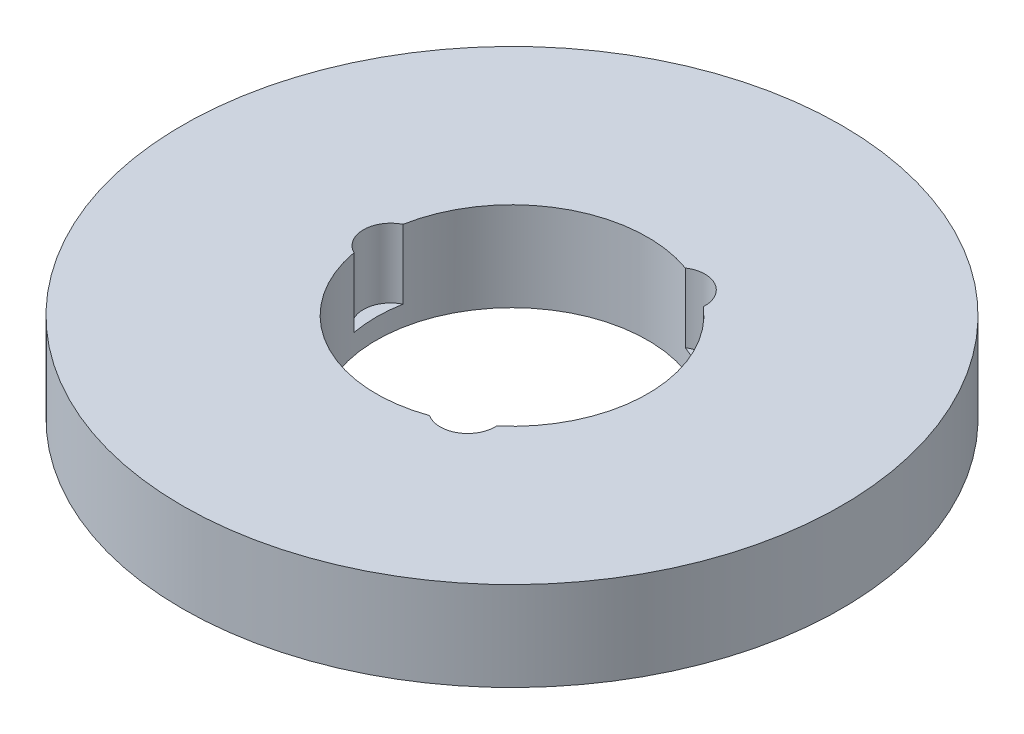
ISO-10303-21;
HEADER;
FILE_DESCRIPTION(('STEP AP214'),'2;1');
FILE_NAME('part.step','',(''),(''),'','','');
FILE_SCHEMA(('AUTOMOTIVE_DESIGN { 1 0 10303 214 1 1 1 1 }'));
ENDSEC;
DATA;
#1=APPLICATION_CONTEXT('core data for automotive mechanical design processes');
#2=APPLICATION_PROTOCOL_DEFINITION('international standard','automotive_design',2000,#1);
#3=PRODUCT_CONTEXT('',#1,'mechanical');
#4=PRODUCT('Part','Part','',(#3));
#5=PRODUCT_RELATED_PRODUCT_CATEGORY('part','',(#4));
#6=PRODUCT_DEFINITION_FORMATION('','',#4);
#7=PRODUCT_DEFINITION_CONTEXT('part definition',#1,'design');
#8=PRODUCT_DEFINITION('design','',#6,#7);
#9=PRODUCT_DEFINITION_SHAPE('','',#8);
#10=(LENGTH_UNIT() NAMED_UNIT(*) SI_UNIT(.MILLI.,.METRE.));
#11=(NAMED_UNIT(*) PLANE_ANGLE_UNIT() SI_UNIT($,.RADIAN.));
#12=(NAMED_UNIT(*) SI_UNIT($,.STERADIAN.) SOLID_ANGLE_UNIT());
#13=UNCERTAINTY_MEASURE_WITH_UNIT(LENGTH_MEASURE(1.E-05),#10,'distance_accuracy_value','');
#14=(GEOMETRIC_REPRESENTATION_CONTEXT(3) GLOBAL_UNCERTAINTY_ASSIGNED_CONTEXT((#13)) GLOBAL_UNIT_ASSIGNED_CONTEXT((#10,
#11,#12)) REPRESENTATION_CONTEXT('',''));
#15=CARTESIAN_POINT('',(0.,0.,0.));
#16=DIRECTION('',(0.,0.,1.));
#17=DIRECTION('',(1.,0.,0.));
#18=AXIS2_PLACEMENT_3D('',#15,#16,#17);
#19=CARTESIAN_POINT('',(0.,23.,0.));
#20=DIRECTION('',(0.,-1.,0.));
#21=DIRECTION('',(0.,0.,-1.));
#22=AXIS2_PLACEMENT_3D('',#19,#20,#21);
#23=CYLINDRICAL_SURFACE('',#22,85.);
#24=CARTESIAN_POINT('',(0.,23.,0.));
#25=DIRECTION('',(0.,1.,0.));
#26=DIRECTION('',(0.,0.,1.));
#27=AXIS2_PLACEMENT_3D('',#24,#25,#26);
#28=CIRCLE('',#27,85.);
#29=CARTESIAN_POINT('',(0.,23.,85.));
#30=VERTEX_POINT('',#29);
#31=EDGE_CURVE('E130',#30,#30,#28,.T.);
#32=ORIENTED_EDGE('',*,*,#31,.F.);
#33=EDGE_LOOP('',(#32));
#34=FACE_BOUND('',#33,.T.);
#35=CARTESIAN_POINT('',(0.,0.,0.));
#36=DIRECTION('',(0.,1.,0.));
#37=DIRECTION('',(0.,0.,1.));
#38=AXIS2_PLACEMENT_3D('',#35,#36,#37);
#39=CIRCLE('',#38,85.);
#40=CARTESIAN_POINT('',(0.,0.,85.));
#41=VERTEX_POINT('',#40);
#42=EDGE_CURVE('E117',#41,#41,#39,.T.);
#43=ORIENTED_EDGE('',*,*,#42,.T.);
#44=EDGE_LOOP('',(#43));
#45=FACE_BOUND('',#44,.T.);
#46=ADVANCED_FACE('F39',(#34,#45),#23,.T.);
#47=CARTESIAN_POINT('',(0.,23.,0.));
#48=DIRECTION('',(0.,1.,0.));
#49=DIRECTION('',(0.,0.,1.));
#50=AXIS2_PLACEMENT_3D('',#47,#48,#49);
#51=PLANE('',#50);
#52=CARTESIAN_POINT('',(15.6275728823636,23.,27.0677502312391));
#53=DIRECTION('',(0.,1.,0.));
#54=DIRECTION('',(0.866025403784436,0.,-0.500000000000004));
#55=AXIS2_PLACEMENT_3D('',#52,#53,#54);
#56=CIRCLE('',#55,7.07740934402539);
#57=CARTESIAN_POINT('',(11.730589182881,23.,32.9756467324369));
#58=VERTEX_POINT('',#57);
#59=CARTESIAN_POINT('',(22.6924531850714,23.,26.6468115999522));
#60=VERTEX_POINT('',#59);
#61=EDGE_CURVE('E148',#58,#60,#56,.T.);
#62=ORIENTED_EDGE('',*,*,#61,.F.);
#63=CARTESIAN_POINT('',(0.,23.,0.));
#64=DIRECTION('',(0.,1.,0.));
#65=DIRECTION('',(0.,0.,1.));
#66=AXIS2_PLACEMENT_3D('',#63,#64,#65);
#67=CIRCLE('',#66,35.);
#68=CARTESIAN_POINT('',(-34.4230423679521,23.,6.32883513248467));
#69=VERTEX_POINT('',#68);
#70=EDGE_CURVE('E113',#69,#58,#67,.T.);
#71=ORIENTED_EDGE('',*,*,#70,.F.);
#72=CARTESIAN_POINT('',(-31.255145764727,23.,0.));
#73=DIRECTION('',(0.,1.,0.));
#74=DIRECTION('',(0.,0.,1.));
#75=AXIS2_PLACEMENT_3D('',#72,#73,#74);
#76=CIRCLE('',#75,7.07740934402539);
#77=CARTESIAN_POINT('',(-34.4230423679521,23.,-6.32883513248467));
#78=VERTEX_POINT('',#77);
#79=EDGE_CURVE('E125',#78,#69,#76,.T.);
#80=ORIENTED_EDGE('',*,*,#79,.F.);
#81=CARTESIAN_POINT('',(11.7305891828806,23.,-32.975646732437));
#82=VERTEX_POINT('',#81);
#83=EDGE_CURVE('E107',#82,#78,#67,.T.);
#84=ORIENTED_EDGE('',*,*,#83,.F.);
#85=CARTESIAN_POINT('',(15.6275728823632,23.,-27.0677502312393));
#86=DIRECTION('',(0.,1.,0.));
#87=DIRECTION('',(-0.866025403784443,0.,-0.499999999999992));
#88=AXIS2_PLACEMENT_3D('',#85,#86,#87);
#89=CIRCLE('',#88,7.07740934402539);
#90=CARTESIAN_POINT('',(22.692453185071,23.,-26.6468115999525));
#91=VERTEX_POINT('',#90);
#92=EDGE_CURVE('E95',#91,#82,#89,.T.);
#93=ORIENTED_EDGE('',*,*,#92,.F.);
#94=EDGE_CURVE('E106',#60,#91,#67,.T.);
#95=ORIENTED_EDGE('',*,*,#94,.F.);
#96=EDGE_LOOP('',(#62,#71,#80,#84,#93,#95));
#97=FACE_BOUND('',#96,.T.);
#98=ORIENTED_EDGE('',*,*,#31,.T.);
#99=EDGE_LOOP('',(#98));
#100=FACE_BOUND('',#99,.T.);
#101=ADVANCED_FACE('F102',(#97,#100),#51,.T.);
#102=CARTESIAN_POINT('',(0.,0.,0.));
#103=DIRECTION('',(0.,1.,0.));
#104=DIRECTION('',(0.,0.,1.));
#105=AXIS2_PLACEMENT_3D('',#102,#103,#104);
#106=PLANE('',#105);
#107=CARTESIAN_POINT('',(0.,0.,0.));
#108=DIRECTION('',(0.,1.,0.));
#109=DIRECTION('',(0.,0.,1.));
#110=AXIS2_PLACEMENT_3D('',#107,#108,#109);
#111=CIRCLE('',#110,35.);
#112=CARTESIAN_POINT('',(0.,0.,35.));
#113=VERTEX_POINT('',#112);
#114=EDGE_CURVE('E118',#113,#113,#111,.T.);
#115=ORIENTED_EDGE('',*,*,#114,.T.);
#116=EDGE_LOOP('',(#115));
#117=FACE_BOUND('',#116,.T.);
#118=ORIENTED_EDGE('',*,*,#42,.F.);
#119=EDGE_LOOP('',(#118));
#120=FACE_BOUND('',#119,.T.);
#121=ADVANCED_FACE('F161',(#117,#120),#106,.F.);
#122=CARTESIAN_POINT('',(0.,23.,0.));
#123=DIRECTION('',(0.,-1.,0.));
#124=DIRECTION('',(0.,0.,-1.));
#125=AXIS2_PLACEMENT_3D('',#122,#123,#124);
#126=CYLINDRICAL_SURFACE('',#125,35.);
#127=DIRECTION('',(0.,1.,0.));
#128=VECTOR('',#127,1.);
#129=CARTESIAN_POINT('',(11.730589182881,14.0856113058301,32.9756467324369));
#130=LINE('',#129,#128);
#131=CARTESIAN_POINT('',(11.730589182881,5.1712226116602,32.9756467324369));
#132=VERTEX_POINT('',#131);
#133=EDGE_CURVE('E11',#132,#58,#130,.T.);
#134=ORIENTED_EDGE('',*,*,#133,.F.);
#135=CARTESIAN_POINT('',(0.,5.1712226116602,0.));
#136=DIRECTION('',(0.,1.,0.));
#137=DIRECTION('',(0.,0.,1.));
#138=AXIS2_PLACEMENT_3D('',#135,#136,#137);
#139=CIRCLE('',#138,35.);
#140=CARTESIAN_POINT('',(22.6924531850714,5.1712226116602,26.6468115999522));
#141=VERTEX_POINT('',#140);
#142=EDGE_CURVE('E100',#132,#141,#139,.T.);
#143=ORIENTED_EDGE('',*,*,#142,.T.);
#144=DIRECTION('',(0.,1.,0.));
#145=VECTOR('',#144,1.);
#146=CARTESIAN_POINT('',(22.6924531850714,14.0856113058301,26.6468115999522));
#147=LINE('',#146,#145);
#148=EDGE_CURVE('E46',#60,#141,#147,.F.);
#149=ORIENTED_EDGE('',*,*,#148,.F.);
#150=ORIENTED_EDGE('',*,*,#94,.T.);
#151=DIRECTION('',(0.,1.,0.));
#152=VECTOR('',#151,1.);
#153=CARTESIAN_POINT('',(22.692453185071,14.0856113058301,-26.6468115999525));
#154=LINE('',#153,#152);
#155=CARTESIAN_POINT('',(22.692453185071,5.1712226116602,-26.6468115999525));
#156=VERTEX_POINT('',#155);
#157=EDGE_CURVE('E90',#156,#91,#154,.T.);
#158=ORIENTED_EDGE('',*,*,#157,.F.);
#159=CARTESIAN_POINT('',(0.,5.1712226116602,0.));
#160=DIRECTION('',(0.,1.,0.));
#161=DIRECTION('',(0.,0.,1.));
#162=AXIS2_PLACEMENT_3D('',#159,#160,#161);
#163=CIRCLE('',#162,35.);
#164=CARTESIAN_POINT('',(11.7305891828806,5.1712226116602,-32.975646732437));
#165=VERTEX_POINT('',#164);
#166=EDGE_CURVE('E143',#156,#165,#163,.T.);
#167=ORIENTED_EDGE('',*,*,#166,.T.);
#168=DIRECTION('',(0.,1.,0.));
#169=VECTOR('',#168,1.);
#170=CARTESIAN_POINT('',(11.7305891828806,14.0856113058301,-32.9756467324371));
#171=LINE('',#170,#169);
#172=EDGE_CURVE('E98',#82,#165,#171,.F.);
#173=ORIENTED_EDGE('',*,*,#172,.F.);
#174=ORIENTED_EDGE('',*,*,#83,.T.);
#175=DIRECTION('',(0.,1.,0.));
#176=VECTOR('',#175,1.);
#177=CARTESIAN_POINT('',(-34.4230423679522,14.0856113058301,-6.32883513248466));
#178=LINE('',#177,#176);
#179=CARTESIAN_POINT('',(-34.4230423679521,5.1712226116602,-6.32883513248467));
#180=VERTEX_POINT('',#179);
#181=EDGE_CURVE('E137',#180,#78,#178,.T.);
#182=ORIENTED_EDGE('',*,*,#181,.F.);
#183=CARTESIAN_POINT('',(0.,5.1712226116602,0.));
#184=DIRECTION('',(0.,1.,0.));
#185=DIRECTION('',(0.,0.,1.));
#186=AXIS2_PLACEMENT_3D('',#183,#184,#185);
#187=CIRCLE('',#186,35.);
#188=CARTESIAN_POINT('',(-34.4230423679521,5.1712226116602,6.32883513248467));
#189=VERTEX_POINT('',#188);
#190=EDGE_CURVE('E128',#180,#189,#187,.T.);
#191=ORIENTED_EDGE('',*,*,#190,.T.);
#192=DIRECTION('',(0.,1.,0.));
#193=VECTOR('',#192,1.);
#194=CARTESIAN_POINT('',(-34.4230423679522,14.0856113058301,6.32883513248466));
#195=LINE('',#194,#193);
#196=EDGE_CURVE('E134',#69,#189,#195,.F.);
#197=ORIENTED_EDGE('',*,*,#196,.F.);
#198=ORIENTED_EDGE('',*,*,#70,.T.);
#199=EDGE_LOOP('',(#134,#143,#149,#150,#158,#167,#173,#174,#182,#191,#197,#198));
#200=FACE_BOUND('',#199,.T.);
#201=ORIENTED_EDGE('',*,*,#114,.F.);
#202=EDGE_LOOP('',(#201));
#203=FACE_BOUND('',#202,.T.);
#204=ADVANCED_FACE('F115',(#200,#203),#126,.F.);
#205=CARTESIAN_POINT('',(-31.255145764727,5.1712226116602,0.));
#206=DIRECTION('',(0.,1.,0.));
#207=DIRECTION('',(0.,0.,1.));
#208=AXIS2_PLACEMENT_3D('',#205,#206,#207);
#209=CYLINDRICAL_SURFACE('',#208,7.07740934402539);
#210=ORIENTED_EDGE('',*,*,#181,.T.);
#211=ORIENTED_EDGE('',*,*,#79,.T.);
#212=ORIENTED_EDGE('',*,*,#196,.T.);
#213=CARTESIAN_POINT('',(-31.255145764727,5.1712226116602,0.));
#214=DIRECTION('',(0.,1.,0.));
#215=DIRECTION('',(0.,0.,1.));
#216=AXIS2_PLACEMENT_3D('',#213,#214,#215);
#217=CIRCLE('',#216,7.07740934402539);
#218=EDGE_CURVE('E127',#180,#189,#217,.T.);
#219=ORIENTED_EDGE('',*,*,#218,.F.);
#220=EDGE_LOOP('',(#210,#211,#212,#219));
#221=FACE_BOUND('',#220,.T.);
#222=ADVANCED_FACE('F175',(#221),#209,.F.);
#223=CARTESIAN_POINT('',(-31.255145764727,5.1712226116602,0.));
#224=DIRECTION('',(0.,1.,0.));
#225=DIRECTION('',(0.,0.,1.));
#226=AXIS2_PLACEMENT_3D('',#223,#224,#225);
#227=PLANE('',#226);
#228=ORIENTED_EDGE('',*,*,#218,.T.);
#229=ORIENTED_EDGE('',*,*,#190,.F.);
#230=EDGE_LOOP('',(#228,#229));
#231=FACE_BOUND('',#230,.T.);
#232=ADVANCED_FACE('F176',(#231),#227,.T.);
#233=CARTESIAN_POINT('',(15.6275728823632,5.1712226116602,-27.0677502312393));
#234=DIRECTION('',(0.,1.,0.));
#235=DIRECTION('',(0.,0.,1.));
#236=AXIS2_PLACEMENT_3D('',#233,#234,#235);
#237=CYLINDRICAL_SURFACE('',#236,7.07740934402539);
#238=ORIENTED_EDGE('',*,*,#157,.T.);
#239=ORIENTED_EDGE('',*,*,#92,.T.);
#240=ORIENTED_EDGE('',*,*,#172,.T.);
#241=CARTESIAN_POINT('',(15.6275728823632,5.1712226116602,-27.0677502312393));
#242=DIRECTION('',(0.,1.,0.));
#243=DIRECTION('',(-0.866025403784443,0.,-0.499999999999992));
#244=AXIS2_PLACEMENT_3D('',#241,#242,#243);
#245=CIRCLE('',#244,7.07740934402539);
#246=EDGE_CURVE('E56',#156,#165,#245,.T.);
#247=ORIENTED_EDGE('',*,*,#246,.F.);
#248=EDGE_LOOP('',(#238,#239,#240,#247));
#249=FACE_BOUND('',#248,.T.);
#250=ADVANCED_FACE('F93',(#249),#237,.F.);
#251=CARTESIAN_POINT('',(15.6275728823632,5.1712226116602,-27.0677502312393));
#252=DIRECTION('',(0.,1.,0.));
#253=DIRECTION('',(-0.866025403784443,0.,-0.499999999999992));
#254=AXIS2_PLACEMENT_3D('',#251,#252,#253);
#255=PLANE('',#254);
#256=ORIENTED_EDGE('',*,*,#246,.T.);
#257=ORIENTED_EDGE('',*,*,#166,.F.);
#258=EDGE_LOOP('',(#256,#257));
#259=FACE_BOUND('',#258,.T.);
#260=ADVANCED_FACE('F153',(#259),#255,.T.);
#261=CARTESIAN_POINT('',(15.6275728823636,5.1712226116602,27.0677502312391));
#262=DIRECTION('',(0.,1.,0.));
#263=DIRECTION('',(0.,0.,1.));
#264=AXIS2_PLACEMENT_3D('',#261,#262,#263);
#265=CYLINDRICAL_SURFACE('',#264,7.07740934402539);
#266=ORIENTED_EDGE('',*,*,#133,.T.);
#267=ORIENTED_EDGE('',*,*,#61,.T.);
#268=ORIENTED_EDGE('',*,*,#148,.T.);
#269=CARTESIAN_POINT('',(15.6275728823636,5.1712226116602,27.0677502312391));
#270=DIRECTION('',(0.,1.,0.));
#271=DIRECTION('',(0.866025403784436,0.,-0.500000000000004));
#272=AXIS2_PLACEMENT_3D('',#269,#270,#271);
#273=CIRCLE('',#272,7.07740934402539);
#274=EDGE_CURVE('E55',#132,#141,#273,.T.);
#275=ORIENTED_EDGE('',*,*,#274,.F.);
#276=EDGE_LOOP('',(#266,#267,#268,#275));
#277=FACE_BOUND('',#276,.T.);
#278=ADVANCED_FACE('F144',(#277),#265,.F.);
#279=CARTESIAN_POINT('',(15.6275728823636,5.1712226116602,27.0677502312391));
#280=DIRECTION('',(0.,1.,0.));
#281=DIRECTION('',(0.866025403784436,0.,-0.500000000000004));
#282=AXIS2_PLACEMENT_3D('',#279,#280,#281);
#283=PLANE('',#282);
#284=ORIENTED_EDGE('',*,*,#274,.T.);
#285=ORIENTED_EDGE('',*,*,#142,.F.);
#286=EDGE_LOOP('',(#284,#285));
#287=FACE_BOUND('',#286,.T.);
#288=ADVANCED_FACE('F150',(#287),#283,.T.);
#289=CLOSED_SHELL('',(#46,#101,#121,#204,#222,#232,#250,#260,#278,#288));
#290=MANIFOLD_SOLID_BREP('B2',#289);
#291=ADVANCED_BREP_SHAPE_REPRESENTATION('',(#18,#290),#14);
#292=SHAPE_DEFINITION_REPRESENTATION(#9,#291);
ENDSEC;
END-ISO-10303-21;
